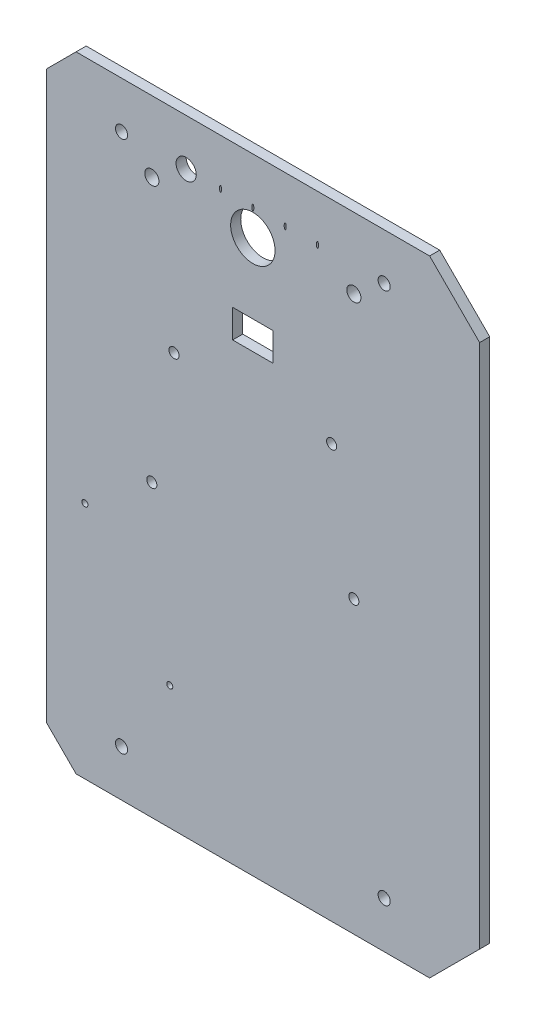
ISO-10303-21;
HEADER;
FILE_DESCRIPTION(('STEP AP214'),'2;1');
FILE_NAME('part.step','',(''),(''),'','','');
FILE_SCHEMA(('AUTOMOTIVE_DESIGN { 1 0 10303 214 1 1 1 1 }'));
ENDSEC;
DATA;
#1=APPLICATION_CONTEXT('core data for automotive mechanical design processes');
#2=APPLICATION_PROTOCOL_DEFINITION('international standard','automotive_design',2000,#1);
#3=PRODUCT_CONTEXT('',#1,'mechanical');
#4=PRODUCT('Part','Part','',(#3));
#5=PRODUCT_RELATED_PRODUCT_CATEGORY('part','',(#4));
#6=PRODUCT_DEFINITION_FORMATION('','',#4);
#7=PRODUCT_DEFINITION_CONTEXT('part definition',#1,'design');
#8=PRODUCT_DEFINITION('design','',#6,#7);
#9=PRODUCT_DEFINITION_SHAPE('','',#8);
#10=(LENGTH_UNIT() NAMED_UNIT(*) SI_UNIT(.MILLI.,.METRE.));
#11=(NAMED_UNIT(*) PLANE_ANGLE_UNIT() SI_UNIT($,.RADIAN.));
#12=(NAMED_UNIT(*) SI_UNIT($,.STERADIAN.) SOLID_ANGLE_UNIT());
#13=UNCERTAINTY_MEASURE_WITH_UNIT(LENGTH_MEASURE(1.E-05),#10,'distance_accuracy_value','');
#14=(GEOMETRIC_REPRESENTATION_CONTEXT(3) GLOBAL_UNCERTAINTY_ASSIGNED_CONTEXT((#13)) GLOBAL_UNIT_ASSIGNED_CONTEXT((#10,
#11,#12)) REPRESENTATION_CONTEXT('',''));
#15=CARTESIAN_POINT('',(0.,0.,0.));
#16=DIRECTION('',(0.,0.,1.));
#17=DIRECTION('',(1.,0.,0.));
#18=AXIS2_PLACEMENT_3D('',#15,#16,#17);
#19=CARTESIAN_POINT('',(24.7487373415291,24.7487373415292,5.));
#20=DIRECTION('',(-0.707106781186548,0.707106781186547,0.));
#21=DIRECTION('',(-0.707106781186547,-0.707106781186548,0.));
#22=AXIS2_PLACEMENT_3D('',#19,#20,#21);
#23=PLANE('',#22);
#24=DIRECTION('',(0.707106781186547,0.707106781186548,0.));
#25=VECTOR('',#24,1.);
#26=CARTESIAN_POINT('',(24.7487373415291,24.7487373415292,0.));
#27=LINE('',#26,#25);
#28=CARTESIAN_POINT('',(0.,0.,0.));
#29=VERTEX_POINT('',#28);
#30=CARTESIAN_POINT('',(24.7487373415291,24.7487373415292,0.));
#31=VERTEX_POINT('',#30);
#32=EDGE_CURVE('E149',#29,#31,#27,.T.);
#33=ORIENTED_EDGE('',*,*,#32,.T.);
#34=DIRECTION('',(0.,0.,-1.));
#35=VECTOR('',#34,1.);
#36=CARTESIAN_POINT('',(24.7487373415291,24.7487373415292,5.));
#37=LINE('',#36,#35);
#38=CARTESIAN_POINT('',(24.7487373415291,24.7487373415292,5.));
#39=VERTEX_POINT('',#38);
#40=EDGE_CURVE('E179',#39,#31,#37,.T.);
#41=ORIENTED_EDGE('',*,*,#40,.F.);
#42=DIRECTION('',(0.707106781186547,0.707106781186548,0.));
#43=VECTOR('',#42,1.);
#44=CARTESIAN_POINT('',(24.7487373415291,24.7487373415292,5.));
#45=LINE('',#44,#43);
#46=CARTESIAN_POINT('',(0.,0.,5.));
#47=VERTEX_POINT('',#46);
#48=EDGE_CURVE('E166',#47,#39,#45,.T.);
#49=ORIENTED_EDGE('',*,*,#48,.F.);
#50=DIRECTION('',(0.,0.,-1.));
#51=VECTOR('',#50,1.);
#52=CARTESIAN_POINT('',(0.,0.,5.));
#53=LINE('',#52,#51);
#54=EDGE_CURVE('E143',#47,#29,#53,.T.);
#55=ORIENTED_EDGE('',*,*,#54,.T.);
#56=EDGE_LOOP('',(#33,#41,#49,#55));
#57=FACE_BOUND('',#56,.T.);
#58=ADVANCED_FACE('F33',(#57),#23,.F.);
#59=CARTESIAN_POINT('',(24.7487373415292,284.748737341529,5.));
#60=DIRECTION('',(-1.,0.,0.));
#61=DIRECTION('',(0.,-1.,0.));
#62=AXIS2_PLACEMENT_3D('',#59,#60,#61);
#63=PLANE('',#62);
#64=DIRECTION('',(0.,1.,0.));
#65=VECTOR('',#64,1.);
#66=CARTESIAN_POINT('',(24.7487373415292,284.748737341529,0.));
#67=LINE('',#66,#65);
#68=CARTESIAN_POINT('',(24.7487373415292,284.748737341529,0.));
#69=VERTEX_POINT('',#68);
#70=EDGE_CURVE('E152',#31,#69,#67,.T.);
#71=ORIENTED_EDGE('',*,*,#70,.T.);
#72=DIRECTION('',(0.,0.,-1.));
#73=VECTOR('',#72,1.);
#74=CARTESIAN_POINT('',(24.7487373415292,284.748737341529,5.));
#75=LINE('',#74,#73);
#76=CARTESIAN_POINT('',(24.7487373415292,284.748737341529,5.));
#77=VERTEX_POINT('',#76);
#78=EDGE_CURVE('E176',#77,#69,#75,.T.);
#79=ORIENTED_EDGE('',*,*,#78,.F.);
#80=DIRECTION('',(0.,1.,0.));
#81=VECTOR('',#80,1.);
#82=CARTESIAN_POINT('',(24.7487373415292,284.748737341529,5.));
#83=LINE('',#82,#81);
#84=EDGE_CURVE('E410',#39,#77,#83,.T.);
#85=ORIENTED_EDGE('',*,*,#84,.F.);
#86=ORIENTED_EDGE('',*,*,#40,.T.);
#87=EDGE_LOOP('',(#71,#79,#85,#86));
#88=FACE_BOUND('',#87,.T.);
#89=ADVANCED_FACE('F291',(#88),#63,.F.);
#90=CARTESIAN_POINT('',(0.,309.497474683058,5.));
#91=DIRECTION('',(-0.707106781186547,-0.707106781186548,0.));
#92=DIRECTION('',(0.707106781186548,-0.707106781186547,0.));
#93=AXIS2_PLACEMENT_3D('',#90,#91,#92);
#94=PLANE('',#93);
#95=DIRECTION('',(-0.707106781186548,0.707106781186547,0.));
#96=VECTOR('',#95,1.);
#97=CARTESIAN_POINT('',(0.,309.497474683058,0.));
#98=LINE('',#97,#96);
#99=CARTESIAN_POINT('',(0.,309.497474683058,0.));
#100=VERTEX_POINT('',#99);
#101=EDGE_CURVE('E155',#69,#100,#98,.T.);
#102=ORIENTED_EDGE('',*,*,#101,.T.);
#103=DIRECTION('',(0.,0.,-1.));
#104=VECTOR('',#103,1.);
#105=CARTESIAN_POINT('',(0.,309.497474683058,5.));
#106=LINE('',#105,#104);
#107=CARTESIAN_POINT('',(0.,309.497474683058,5.));
#108=VERTEX_POINT('',#107);
#109=EDGE_CURVE('E173',#108,#100,#106,.T.);
#110=ORIENTED_EDGE('',*,*,#109,.F.);
#111=DIRECTION('',(-0.707106781186548,0.707106781186547,0.));
#112=VECTOR('',#111,1.);
#113=CARTESIAN_POINT('',(0.,309.497474683058,5.));
#114=LINE('',#113,#112);
#115=EDGE_CURVE('E306',#77,#108,#114,.T.);
#116=ORIENTED_EDGE('',*,*,#115,.F.);
#117=ORIENTED_EDGE('',*,*,#78,.T.);
#118=EDGE_LOOP('',(#102,#110,#116,#117));
#119=FACE_BOUND('',#118,.T.);
#120=ADVANCED_FACE('F288',(#119),#94,.F.);
#121=CARTESIAN_POINT('',(-175.,309.497474683058,5.));
#122=DIRECTION('',(0.,-1.,0.));
#123=DIRECTION('',(0.,0.,-1.));
#124=AXIS2_PLACEMENT_3D('',#121,#122,#123);
#125=PLANE('',#124);
#126=DIRECTION('',(-1.,0.,0.));
#127=VECTOR('',#126,1.);
#128=CARTESIAN_POINT('',(-175.,309.497474683058,0.));
#129=LINE('',#128,#127);
#130=CARTESIAN_POINT('',(-175.,309.497474683058,0.));
#131=VERTEX_POINT('',#130);
#132=EDGE_CURVE('E157',#100,#131,#129,.T.);
#133=ORIENTED_EDGE('',*,*,#132,.T.);
#134=DIRECTION('',(0.,0.,-1.));
#135=VECTOR('',#134,1.);
#136=CARTESIAN_POINT('',(-175.,309.497474683058,5.));
#137=LINE('',#136,#135);
#138=CARTESIAN_POINT('',(-175.,309.497474683058,5.));
#139=VERTEX_POINT('',#138);
#140=EDGE_CURVE('E170',#139,#131,#137,.T.);
#141=ORIENTED_EDGE('',*,*,#140,.F.);
#142=DIRECTION('',(-1.,0.,0.));
#143=VECTOR('',#142,1.);
#144=CARTESIAN_POINT('',(-175.,309.497474683058,5.));
#145=LINE('',#144,#143);
#146=EDGE_CURVE('E145',#108,#139,#145,.T.);
#147=ORIENTED_EDGE('',*,*,#146,.F.);
#148=ORIENTED_EDGE('',*,*,#109,.T.);
#149=EDGE_LOOP('',(#133,#141,#147,#148));
#150=FACE_BOUND('',#149,.T.);
#151=ADVANCED_FACE('F284',(#150),#125,.F.);
#152=CARTESIAN_POINT('',(-199.748737341529,284.748737341529,5.));
#153=DIRECTION('',(0.707106781186548,-0.707106781186548,0.));
#154=DIRECTION('',(0.707106781186548,0.707106781186548,0.));
#155=AXIS2_PLACEMENT_3D('',#152,#153,#154);
#156=PLANE('',#155);
#157=DIRECTION('',(-0.707106781186547,-0.707106781186547,0.));
#158=VECTOR('',#157,1.);
#159=CARTESIAN_POINT('',(-199.748737341529,284.748737341529,0.));
#160=LINE('',#159,#158);
#161=CARTESIAN_POINT('',(-189.748737341529,294.748737341529,0.));
#162=VERTEX_POINT('',#161);
#163=EDGE_CURVE('E159',#131,#162,#160,.T.);
#164=ORIENTED_EDGE('',*,*,#163,.T.);
#165=DIRECTION('',(0.,0.,1.));
#166=VECTOR('',#165,1.);
#167=CARTESIAN_POINT('',(-189.748737341529,294.748737341529,5.));
#168=LINE('',#167,#166);
#169=CARTESIAN_POINT('',(-189.748737341529,294.748737341529,5.));
#170=VERTEX_POINT('',#169);
#171=EDGE_CURVE('E46',#162,#170,#168,.T.);
#172=ORIENTED_EDGE('',*,*,#171,.T.);
#173=DIRECTION('',(-0.707106781186547,-0.707106781186547,0.));
#174=VECTOR('',#173,1.);
#175=CARTESIAN_POINT('',(-199.748737341529,284.748737341529,5.));
#176=LINE('',#175,#174);
#177=EDGE_CURVE('E134',#139,#170,#176,.T.);
#178=ORIENTED_EDGE('',*,*,#177,.F.);
#179=ORIENTED_EDGE('',*,*,#140,.T.);
#180=EDGE_LOOP('',(#164,#172,#178,#179));
#181=FACE_BOUND('',#180,.T.);
#182=ADVANCED_FACE('F281',(#181),#156,.F.);
#183=CARTESIAN_POINT('',(-175.,0.,5.));
#184=DIRECTION('',(0.707106781186547,0.707106781186548,0.));
#185=DIRECTION('',(-0.707106781186548,0.707106781186547,0.));
#186=AXIS2_PLACEMENT_3D('',#183,#184,#185);
#187=PLANE('',#186);
#188=DIRECTION('',(0.707106781186548,-0.707106781186547,0.));
#189=VECTOR('',#188,1.);
#190=CARTESIAN_POINT('',(-175.,0.,5.));
#191=LINE('',#190,#189);
#192=CARTESIAN_POINT('',(-189.748737341529,14.7487373415291,5.));
#193=VERTEX_POINT('',#192);
#194=CARTESIAN_POINT('',(-175.,0.,5.));
#195=VERTEX_POINT('',#194);
#196=EDGE_CURVE('E131',#193,#195,#191,.T.);
#197=ORIENTED_EDGE('',*,*,#196,.F.);
#198=DIRECTION('',(0.,0.,-1.));
#199=VECTOR('',#198,1.);
#200=CARTESIAN_POINT('',(-189.748737341529,14.7487373415291,5.));
#201=LINE('',#200,#199);
#202=CARTESIAN_POINT('',(-189.748737341529,14.7487373415291,0.));
#203=VERTEX_POINT('',#202);
#204=EDGE_CURVE('E119',#193,#203,#201,.T.);
#205=ORIENTED_EDGE('',*,*,#204,.T.);
#206=DIRECTION('',(0.707106781186548,-0.707106781186547,0.));
#207=VECTOR('',#206,1.);
#208=CARTESIAN_POINT('',(-175.,0.,0.));
#209=LINE('',#208,#207);
#210=CARTESIAN_POINT('',(-175.,0.,0.));
#211=VERTEX_POINT('',#210);
#212=EDGE_CURVE('E162',#203,#211,#209,.T.);
#213=ORIENTED_EDGE('',*,*,#212,.T.);
#214=DIRECTION('',(0.,0.,-1.));
#215=VECTOR('',#214,1.);
#216=CARTESIAN_POINT('',(-175.,0.,5.));
#217=LINE('',#216,#215);
#218=EDGE_CURVE('E139',#195,#211,#217,.T.);
#219=ORIENTED_EDGE('',*,*,#218,.F.);
#220=EDGE_LOOP('',(#197,#205,#213,#219));
#221=FACE_BOUND('',#220,.T.);
#222=ADVANCED_FACE('F137',(#221),#187,.F.);
#223=CARTESIAN_POINT('',(0.,0.,5.));
#224=DIRECTION('',(0.,1.,0.));
#225=DIRECTION('',(0.,0.,1.));
#226=AXIS2_PLACEMENT_3D('',#223,#224,#225);
#227=PLANE('',#226);
#228=DIRECTION('',(1.,0.,0.));
#229=VECTOR('',#228,1.);
#230=CARTESIAN_POINT('',(0.,0.,0.));
#231=LINE('',#230,#229);
#232=EDGE_CURVE('E164',#211,#29,#231,.T.);
#233=ORIENTED_EDGE('',*,*,#232,.T.);
#234=ORIENTED_EDGE('',*,*,#54,.F.);
#235=DIRECTION('',(1.,0.,0.));
#236=VECTOR('',#235,1.);
#237=CARTESIAN_POINT('',(0.,0.,5.));
#238=LINE('',#237,#236);
#239=EDGE_CURVE('E141',#195,#47,#238,.T.);
#240=ORIENTED_EDGE('',*,*,#239,.F.);
#241=ORIENTED_EDGE('',*,*,#218,.T.);
#242=EDGE_LOOP('',(#233,#234,#240,#241));
#243=FACE_BOUND('',#242,.T.);
#244=ADVANCED_FACE('F271',(#243),#227,.F.);
#245=CARTESIAN_POINT('',(0.,0.,5.));
#246=DIRECTION('',(0.,0.,-1.));
#247=DIRECTION('',(-1.,0.,0.));
#248=AXIS2_PLACEMENT_3D('',#245,#246,#247);
#249=PLANE('',#248);
#250=CARTESIAN_POINT('',(-128.614939474584,61.1523718393633,5.));
#251=DIRECTION('',(0.,0.,1.));
#252=DIRECTION('',(1.,0.,0.));
#253=AXIS2_PLACEMENT_3D('',#250,#251,#252);
#254=CIRCLE('',#253,1.49999999999997);
#255=CARTESIAN_POINT('',(-127.114939474584,61.1523718393633,5.));
#256=VERTEX_POINT('',#255);
#257=EDGE_CURVE('E508',#256,#256,#254,.T.);
#258=ORIENTED_EDGE('',*,*,#257,.F.);
#259=EDGE_LOOP('',(#258));
#260=FACE_BOUND('',#259,.T.);
#261=CARTESIAN_POINT('',(-170.614939474584,118.152371839363,5.));
#262=DIRECTION('',(0.,0.,1.));
#263=DIRECTION('',(1.,0.,0.));
#264=AXIS2_PLACEMENT_3D('',#261,#262,#263);
#265=CIRCLE('',#264,1.5);
#266=CARTESIAN_POINT('',(-169.114939474584,118.152371839363,5.));
#267=VERTEX_POINT('',#266);
#268=EDGE_CURVE('E135',#267,#267,#265,.T.);
#269=ORIENTED_EDGE('',*,*,#268,.F.);
#270=EDGE_LOOP('',(#269));
#271=FACE_BOUND('',#270,.T.);
#272=CARTESIAN_POINT('',(-137.5,143.748737341529,5.));
#273=DIRECTION('',(0.,0.,1.));
#274=DIRECTION('',(1.,0.,0.));
#275=AXIS2_PLACEMENT_3D('',#272,#273,#274);
#276=CIRCLE('',#275,2.5);
#277=CARTESIAN_POINT('',(-135.,143.748737341529,5.));
#278=VERTEX_POINT('',#277);
#279=EDGE_CURVE('E321',#278,#278,#276,.T.);
#280=ORIENTED_EDGE('',*,*,#279,.F.);
#281=EDGE_LOOP('',(#280));
#282=FACE_BOUND('',#281,.T.);
#283=CARTESIAN_POINT('',(-22.5012626584709,286.497474683058,5.));
#284=DIRECTION('',(0.,0.,1.));
#285=DIRECTION('',(1.,0.,0.));
#286=AXIS2_PLACEMENT_3D('',#283,#284,#285);
#287=CIRCLE('',#286,3.00000000000001);
#288=CARTESIAN_POINT('',(-19.5012626584709,286.497474683058,5.));
#289=VERTEX_POINT('',#288);
#290=EDGE_CURVE('E324',#289,#289,#287,.T.);
#291=ORIENTED_EDGE('',*,*,#290,.F.);
#292=EDGE_LOOP('',(#291));
#293=FACE_BOUND('',#292,.T.);
#294=CARTESIAN_POINT('',(-22.5012626584708,23.,5.));
#295=DIRECTION('',(0.,0.,1.));
#296=DIRECTION('',(-1.,0.,0.));
#297=AXIS2_PLACEMENT_3D('',#294,#295,#296);
#298=CIRCLE('',#297,2.99999999999999);
#299=CARTESIAN_POINT('',(-25.5012626584708,23.,5.));
#300=VERTEX_POINT('',#299);
#301=EDGE_CURVE('E327',#300,#300,#298,.T.);
#302=ORIENTED_EDGE('',*,*,#301,.F.);
#303=EDGE_LOOP('',(#302));
#304=FACE_BOUND('',#303,.T.);
#305=CARTESIAN_POINT('',(-152.498737341529,286.497474683058,5.));
#306=DIRECTION('',(0.,0.,1.));
#307=DIRECTION('',(-1.,0.,0.));
#308=AXIS2_PLACEMENT_3D('',#305,#306,#307);
#309=CIRCLE('',#308,2.99999999999999);
#310=CARTESIAN_POINT('',(-155.498737341529,286.497474683058,5.));
#311=VERTEX_POINT('',#310);
#312=EDGE_CURVE('E330',#311,#311,#309,.T.);
#313=ORIENTED_EDGE('',*,*,#312,.F.);
#314=EDGE_LOOP('',(#313));
#315=FACE_BOUND('',#314,.T.);
#316=CARTESIAN_POINT('',(-48.5,204.748737341529,5.));
#317=DIRECTION('',(0.,0.,1.));
#318=DIRECTION('',(-1.,0.,0.));
#319=AXIS2_PLACEMENT_3D('',#316,#317,#318);
#320=CIRCLE('',#319,2.5);
#321=CARTESIAN_POINT('',(-51.,204.748737341529,5.));
#322=VERTEX_POINT('',#321);
#323=EDGE_CURVE('E312',#322,#322,#320,.T.);
#324=ORIENTED_EDGE('',*,*,#323,.F.);
#325=EDGE_LOOP('',(#324));
#326=FACE_BOUND('',#325,.T.);
#327=CARTESIAN_POINT('',(-37.5,143.748737341529,5.));
#328=DIRECTION('',(0.,0.,1.));
#329=DIRECTION('',(-1.,0.,0.));
#330=AXIS2_PLACEMENT_3D('',#327,#328,#329);
#331=CIRCLE('',#330,2.5);
#332=CARTESIAN_POINT('',(-40.,143.748737341529,5.));
#333=VERTEX_POINT('',#332);
#334=EDGE_CURVE('E315',#333,#333,#331,.T.);
#335=ORIENTED_EDGE('',*,*,#334,.F.);
#336=EDGE_LOOP('',(#335));
#337=FACE_BOUND('',#336,.T.);
#338=CARTESIAN_POINT('',(-126.5,204.748737341529,5.));
#339=DIRECTION('',(0.,0.,1.));
#340=DIRECTION('',(1.,0.,0.));
#341=AXIS2_PLACEMENT_3D('',#338,#339,#340);
#342=CIRCLE('',#341,2.5);
#343=CARTESIAN_POINT('',(-124.,204.748737341529,5.));
#344=VERTEX_POINT('',#343);
#345=EDGE_CURVE('E318',#344,#344,#342,.T.);
#346=ORIENTED_EDGE('',*,*,#345,.F.);
#347=EDGE_LOOP('',(#346));
#348=FACE_BOUND('',#347,.T.);
#349=CARTESIAN_POINT('',(-152.498737341529,23.,5.));
#350=DIRECTION('',(0.,0.,1.));
#351=DIRECTION('',(1.,0.,0.));
#352=AXIS2_PLACEMENT_3D('',#349,#350,#351);
#353=CIRCLE('',#352,2.99999999999999);
#354=CARTESIAN_POINT('',(-149.498737341529,23.,5.));
#355=VERTEX_POINT('',#354);
#356=EDGE_CURVE('E219',#355,#355,#353,.T.);
#357=ORIENTED_EDGE('',*,*,#356,.F.);
#358=EDGE_LOOP('',(#357));
#359=FACE_BOUND('',#358,.T.);
#360=CARTESIAN_POINT('',(-55.5,286.497474683058,5.));
#361=DIRECTION('',(0.,0.,1.));
#362=DIRECTION('',(0.,-1.,0.));
#363=AXIS2_PLACEMENT_3D('',#360,#361,#362);
#364=ELLIPSE('',#363,1.5,0.5);
#365=CARTESIAN_POINT('',(-55.5,284.997474683058,5.));
#366=VERTEX_POINT('',#365);
#367=EDGE_CURVE('E238',#366,#366,#364,.T.);
#368=ORIENTED_EDGE('',*,*,#367,.F.);
#369=EDGE_LOOP('',(#368));
#370=FACE_BOUND('',#369,.T.);
#371=CARTESIAN_POINT('',(-71.5,286.497474683058,5.));
#372=DIRECTION('',(0.,0.,1.));
#373=DIRECTION('',(0.,-1.,0.));
#374=AXIS2_PLACEMENT_3D('',#371,#372,#373);
#375=ELLIPSE('',#374,1.5,0.5);
#376=CARTESIAN_POINT('',(-71.5,284.997474683058,5.));
#377=VERTEX_POINT('',#376);
#378=EDGE_CURVE('E242',#377,#377,#375,.T.);
#379=ORIENTED_EDGE('',*,*,#378,.F.);
#380=EDGE_LOOP('',(#379));
#381=FACE_BOUND('',#380,.T.);
#382=CARTESIAN_POINT('',(-87.5,286.497474683058,5.));
#383=DIRECTION('',(0.,0.,1.));
#384=DIRECTION('',(0.,-1.,0.));
#385=AXIS2_PLACEMENT_3D('',#382,#383,#384);
#386=ELLIPSE('',#385,1.5,0.5);
#387=CARTESIAN_POINT('',(-87.5,284.997474683058,5.));
#388=VERTEX_POINT('',#387);
#389=EDGE_CURVE('E247',#388,#388,#386,.T.);
#390=ORIENTED_EDGE('',*,*,#389,.F.);
#391=EDGE_LOOP('',(#390));
#392=FACE_BOUND('',#391,.T.);
#393=CARTESIAN_POINT('',(-87.5,273.497474683058,5.));
#394=DIRECTION('',(0.,0.,1.));
#395=DIRECTION('',(1.,0.,0.));
#396=AXIS2_PLACEMENT_3D('',#393,#394,#395);
#397=CIRCLE('',#396,11.);
#398=CARTESIAN_POINT('',(-76.5,273.497474683058,5.));
#399=VERTEX_POINT('',#398);
#400=EDGE_CURVE('E359',#399,#399,#397,.T.);
#401=ORIENTED_EDGE('',*,*,#400,.F.);
#402=EDGE_LOOP('',(#401));
#403=FACE_BOUND('',#402,.T.);
#404=CARTESIAN_POINT('',(-37.5,274.497474683058,5.));
#405=DIRECTION('',(0.,0.,1.));
#406=DIRECTION('',(1.,0.,0.));
#407=AXIS2_PLACEMENT_3D('',#404,#405,#406);
#408=CIRCLE('',#407,3.50000000000001);
#409=CARTESIAN_POINT('',(-34.,274.497474683058,5.));
#410=VERTEX_POINT('',#409);
#411=EDGE_CURVE('E340',#410,#410,#408,.T.);
#412=ORIENTED_EDGE('',*,*,#411,.F.);
#413=EDGE_LOOP('',(#412));
#414=FACE_BOUND('',#413,.T.);
#415=CARTESIAN_POINT('',(-137.5,274.497474683058,5.));
#416=DIRECTION('',(0.,0.,1.));
#417=DIRECTION('',(1.,0.,0.));
#418=AXIS2_PLACEMENT_3D('',#415,#416,#417);
#419=CIRCLE('',#418,3.50000000000002);
#420=CARTESIAN_POINT('',(-134.,274.497474683058,5.));
#421=VERTEX_POINT('',#420);
#422=EDGE_CURVE('E337',#421,#421,#419,.T.);
#423=ORIENTED_EDGE('',*,*,#422,.F.);
#424=EDGE_LOOP('',(#423));
#425=FACE_BOUND('',#424,.T.);
#426=DIRECTION('',(1.,0.,0.));
#427=VECTOR('',#426,1.);
#428=CARTESIAN_POINT('',(-97.5,224.748737341529,5.));
#429=LINE('',#428,#427);
#430=CARTESIAN_POINT('',(-97.5,224.748737341529,5.));
#431=VERTEX_POINT('',#430);
#432=CARTESIAN_POINT('',(-77.5,224.748737341529,5.));
#433=VERTEX_POINT('',#432);
#434=EDGE_CURVE('E343',#431,#433,#429,.T.);
#435=ORIENTED_EDGE('',*,*,#434,.F.);
#436=DIRECTION('',(0.,-1.,0.));
#437=VECTOR('',#436,1.);
#438=CARTESIAN_POINT('',(-97.5,238.748737341529,5.));
#439=LINE('',#438,#437);
#440=CARTESIAN_POINT('',(-97.5,238.748737341529,5.));
#441=VERTEX_POINT('',#440);
#442=EDGE_CURVE('E54',#441,#431,#439,.T.);
#443=ORIENTED_EDGE('',*,*,#442,.F.);
#444=DIRECTION('',(-1.,0.,0.));
#445=VECTOR('',#444,1.);
#446=CARTESIAN_POINT('',(-97.5,238.748737341529,5.));
#447=LINE('',#446,#445);
#448=CARTESIAN_POINT('',(-77.5,238.748737341529,5.));
#449=VERTEX_POINT('',#448);
#450=EDGE_CURVE('E349',#449,#441,#447,.T.);
#451=ORIENTED_EDGE('',*,*,#450,.F.);
#452=DIRECTION('',(0.,1.,0.));
#453=VECTOR('',#452,1.);
#454=CARTESIAN_POINT('',(-77.5,238.748737341529,5.));
#455=LINE('',#454,#453);
#456=EDGE_CURVE('E346',#433,#449,#455,.T.);
#457=ORIENTED_EDGE('',*,*,#456,.F.);
#458=EDGE_LOOP('',(#435,#443,#451,#457));
#459=FACE_BOUND('',#458,.T.);
#460=CARTESIAN_POINT('',(-103.5,286.497474683058,5.));
#461=DIRECTION('',(0.,0.,1.));
#462=DIRECTION('',(0.,-1.,0.));
#463=AXIS2_PLACEMENT_3D('',#460,#461,#462);
#464=ELLIPSE('',#463,1.5,0.5);
#465=CARTESIAN_POINT('',(-103.5,284.997474683058,5.));
#466=VERTEX_POINT('',#465);
#467=EDGE_CURVE('E190',#466,#466,#464,.T.);
#468=ORIENTED_EDGE('',*,*,#467,.F.);
#469=EDGE_LOOP('',(#468));
#470=FACE_BOUND('',#469,.T.);
#471=CARTESIAN_POINT('',(-120.5,286.497474683058,5.));
#472=DIRECTION('',(0.,0.,1.));
#473=DIRECTION('',(1.,0.,0.));
#474=AXIS2_PLACEMENT_3D('',#471,#472,#473);
#475=CIRCLE('',#474,5.00000000000001);
#476=CARTESIAN_POINT('',(-115.5,286.497474683058,5.));
#477=VERTEX_POINT('',#476);
#478=EDGE_CURVE('E185',#477,#477,#475,.T.);
#479=ORIENTED_EDGE('',*,*,#478,.F.);
#480=EDGE_LOOP('',(#479));
#481=FACE_BOUND('',#480,.T.);
#482=ORIENTED_EDGE('',*,*,#177,.T.);
#483=DIRECTION('',(0.,1.,0.));
#484=VECTOR('',#483,1.);
#485=CARTESIAN_POINT('',(-189.748737341529,134.748737341529,5.));
#486=LINE('',#485,#484);
#487=EDGE_CURVE('E122',#193,#170,#486,.T.);
#488=ORIENTED_EDGE('',*,*,#487,.F.);
#489=ORIENTED_EDGE('',*,*,#196,.T.);
#490=ORIENTED_EDGE('',*,*,#239,.T.);
#491=ORIENTED_EDGE('',*,*,#48,.T.);
#492=ORIENTED_EDGE('',*,*,#84,.T.);
#493=ORIENTED_EDGE('',*,*,#115,.T.);
#494=ORIENTED_EDGE('',*,*,#146,.T.);
#495=EDGE_LOOP('',(#482,#488,#489,#490,#491,#492,#493,#494));
#496=FACE_BOUND('',#495,.T.);
#497=ADVANCED_FACE('F130',(#260,#271,#282,#293,#304,#315,#326,#337,#348,#359,#370,#381,#392,
#403,#414,#425,#459,#470,#481,#496),#249,.F.);
#498=CARTESIAN_POINT('',(0.,0.,0.));
#499=DIRECTION('',(0.,0.,-1.));
#500=DIRECTION('',(-1.,0.,0.));
#501=AXIS2_PLACEMENT_3D('',#498,#499,#500);
#502=PLANE('',#501);
#503=CARTESIAN_POINT('',(-128.614939474584,61.1523718393633,0.));
#504=DIRECTION('',(0.,0.,1.));
#505=DIRECTION('',(1.,0.,0.));
#506=AXIS2_PLACEMENT_3D('',#503,#504,#505);
#507=CIRCLE('',#506,1.49999999999997);
#508=CARTESIAN_POINT('',(-127.114939474584,61.1523718393633,0.));
#509=VERTEX_POINT('',#508);
#510=EDGE_CURVE('E126',#509,#509,#507,.T.);
#511=ORIENTED_EDGE('',*,*,#510,.T.);
#512=EDGE_LOOP('',(#511));
#513=FACE_BOUND('',#512,.T.);
#514=CARTESIAN_POINT('',(-170.614939474584,118.152371839363,0.));
#515=DIRECTION('',(0.,0.,1.));
#516=DIRECTION('',(1.,0.,0.));
#517=AXIS2_PLACEMENT_3D('',#514,#515,#516);
#518=CIRCLE('',#517,1.5);
#519=CARTESIAN_POINT('',(-169.114939474584,118.152371839363,0.));
#520=VERTEX_POINT('',#519);
#521=EDGE_CURVE('E509',#520,#520,#518,.T.);
#522=ORIENTED_EDGE('',*,*,#521,.T.);
#523=EDGE_LOOP('',(#522));
#524=FACE_BOUND('',#523,.T.);
#525=DIRECTION('',(0.,-1.,0.));
#526=VECTOR('',#525,1.);
#527=CARTESIAN_POINT('',(-189.748737341529,0.,0.));
#528=LINE('',#527,#526);
#529=EDGE_CURVE('E11',#162,#203,#528,.T.);
#530=ORIENTED_EDGE('',*,*,#529,.F.);
#531=ORIENTED_EDGE('',*,*,#163,.F.);
#532=ORIENTED_EDGE('',*,*,#132,.F.);
#533=ORIENTED_EDGE('',*,*,#101,.F.);
#534=ORIENTED_EDGE('',*,*,#70,.F.);
#535=ORIENTED_EDGE('',*,*,#32,.F.);
#536=ORIENTED_EDGE('',*,*,#232,.F.);
#537=ORIENTED_EDGE('',*,*,#212,.F.);
#538=EDGE_LOOP('',(#530,#531,#532,#533,#534,#535,#536,#537));
#539=FACE_BOUND('',#538,.T.);
#540=CARTESIAN_POINT('',(-137.5,143.748737341529,0.));
#541=DIRECTION('',(0.,0.,-1.));
#542=DIRECTION('',(-1.,0.,0.));
#543=AXIS2_PLACEMENT_3D('',#540,#541,#542);
#544=CIRCLE('',#543,2.5);
#545=CARTESIAN_POINT('',(-140.,143.748737341529,0.));
#546=VERTEX_POINT('',#545);
#547=EDGE_CURVE('E236',#546,#546,#544,.T.);
#548=ORIENTED_EDGE('',*,*,#547,.F.);
#549=EDGE_LOOP('',(#548));
#550=FACE_BOUND('',#549,.T.);
#551=CARTESIAN_POINT('',(-22.5012626584709,286.497474683058,0.));
#552=DIRECTION('',(0.,0.,-1.));
#553=DIRECTION('',(-1.,0.,0.));
#554=AXIS2_PLACEMENT_3D('',#551,#552,#553);
#555=CIRCLE('',#554,3.00000000000001);
#556=CARTESIAN_POINT('',(-25.5012626584709,286.497474683058,0.));
#557=VERTEX_POINT('',#556);
#558=EDGE_CURVE('E234',#557,#557,#555,.T.);
#559=ORIENTED_EDGE('',*,*,#558,.F.);
#560=EDGE_LOOP('',(#559));
#561=FACE_BOUND('',#560,.T.);
#562=CARTESIAN_POINT('',(-22.5012626584708,23.,0.));
#563=DIRECTION('',(0.,0.,-1.));
#564=DIRECTION('',(-1.,0.,0.));
#565=AXIS2_PLACEMENT_3D('',#562,#563,#564);
#566=CIRCLE('',#565,2.99999999999999);
#567=CARTESIAN_POINT('',(-25.5012626584708,23.,0.));
#568=VERTEX_POINT('',#567);
#569=EDGE_CURVE('E231',#568,#568,#566,.T.);
#570=ORIENTED_EDGE('',*,*,#569,.F.);
#571=EDGE_LOOP('',(#570));
#572=FACE_BOUND('',#571,.T.);
#573=CARTESIAN_POINT('',(-152.498737341529,286.497474683058,0.));
#574=DIRECTION('',(0.,0.,-1.));
#575=DIRECTION('',(-1.,0.,0.));
#576=AXIS2_PLACEMENT_3D('',#573,#574,#575);
#577=CIRCLE('',#576,2.99999999999999);
#578=CARTESIAN_POINT('',(-155.498737341529,286.497474683058,0.));
#579=VERTEX_POINT('',#578);
#580=EDGE_CURVE('E228',#579,#579,#577,.T.);
#581=ORIENTED_EDGE('',*,*,#580,.F.);
#582=EDGE_LOOP('',(#581));
#583=FACE_BOUND('',#582,.T.);
#584=CARTESIAN_POINT('',(-48.5,204.748737341529,0.));
#585=DIRECTION('',(0.,0.,-1.));
#586=DIRECTION('',(-1.,0.,0.));
#587=AXIS2_PLACEMENT_3D('',#584,#585,#586);
#588=CIRCLE('',#587,2.5);
#589=CARTESIAN_POINT('',(-51.,204.748737341529,0.));
#590=VERTEX_POINT('',#589);
#591=EDGE_CURVE('E225',#590,#590,#588,.T.);
#592=ORIENTED_EDGE('',*,*,#591,.F.);
#593=EDGE_LOOP('',(#592));
#594=FACE_BOUND('',#593,.T.);
#595=CARTESIAN_POINT('',(-37.5,143.748737341529,0.));
#596=DIRECTION('',(0.,0.,-1.));
#597=DIRECTION('',(-1.,0.,0.));
#598=AXIS2_PLACEMENT_3D('',#595,#596,#597);
#599=CIRCLE('',#598,2.5);
#600=CARTESIAN_POINT('',(-40.,143.748737341529,0.));
#601=VERTEX_POINT('',#600);
#602=EDGE_CURVE('E222',#601,#601,#599,.T.);
#603=ORIENTED_EDGE('',*,*,#602,.F.);
#604=EDGE_LOOP('',(#603));
#605=FACE_BOUND('',#604,.T.);
#606=CARTESIAN_POINT('',(-126.5,204.748737341529,0.));
#607=DIRECTION('',(0.,0.,-1.));
#608=DIRECTION('',(-1.,0.,0.));
#609=AXIS2_PLACEMENT_3D('',#606,#607,#608);
#610=CIRCLE('',#609,2.5);
#611=CARTESIAN_POINT('',(-129.,204.748737341529,0.));
#612=VERTEX_POINT('',#611);
#613=EDGE_CURVE('E218',#612,#612,#610,.T.);
#614=ORIENTED_EDGE('',*,*,#613,.F.);
#615=EDGE_LOOP('',(#614));
#616=FACE_BOUND('',#615,.T.);
#617=CARTESIAN_POINT('',(-152.498737341529,23.,0.));
#618=DIRECTION('',(0.,0.,-1.));
#619=DIRECTION('',(-1.,0.,0.));
#620=AXIS2_PLACEMENT_3D('',#617,#618,#619);
#621=CIRCLE('',#620,2.99999999999999);
#622=CARTESIAN_POINT('',(-155.498737341529,23.,0.));
#623=VERTEX_POINT('',#622);
#624=EDGE_CURVE('E215',#623,#623,#621,.T.);
#625=ORIENTED_EDGE('',*,*,#624,.F.);
#626=EDGE_LOOP('',(#625));
#627=FACE_BOUND('',#626,.T.);
#628=CARTESIAN_POINT('',(-55.5,286.497474683058,0.));
#629=DIRECTION('',(0.,0.,1.));
#630=DIRECTION('',(0.,-1.,0.));
#631=AXIS2_PLACEMENT_3D('',#628,#629,#630);
#632=ELLIPSE('',#631,1.5,0.5);
#633=CARTESIAN_POINT('',(-55.5,284.997474683058,0.));
#634=VERTEX_POINT('',#633);
#635=EDGE_CURVE('E212',#634,#634,#632,.F.);
#636=ORIENTED_EDGE('',*,*,#635,.F.);
#637=EDGE_LOOP('',(#636));
#638=FACE_BOUND('',#637,.T.);
#639=CARTESIAN_POINT('',(-71.5,286.497474683058,0.));
#640=DIRECTION('',(0.,0.,1.));
#641=DIRECTION('',(0.,-1.,0.));
#642=AXIS2_PLACEMENT_3D('',#639,#640,#641);
#643=ELLIPSE('',#642,1.5,0.5);
#644=CARTESIAN_POINT('',(-71.5,284.997474683058,0.));
#645=VERTEX_POINT('',#644);
#646=EDGE_CURVE('E209',#645,#645,#643,.F.);
#647=ORIENTED_EDGE('',*,*,#646,.F.);
#648=EDGE_LOOP('',(#647));
#649=FACE_BOUND('',#648,.T.);
#650=CARTESIAN_POINT('',(-87.5,286.497474683058,0.));
#651=DIRECTION('',(0.,0.,1.));
#652=DIRECTION('',(0.,-1.,0.));
#653=AXIS2_PLACEMENT_3D('',#650,#651,#652);
#654=ELLIPSE('',#653,1.5,0.5);
#655=CARTESIAN_POINT('',(-87.5,284.997474683058,0.));
#656=VERTEX_POINT('',#655);
#657=EDGE_CURVE('E206',#656,#656,#654,.F.);
#658=ORIENTED_EDGE('',*,*,#657,.F.);
#659=EDGE_LOOP('',(#658));
#660=FACE_BOUND('',#659,.T.);
#661=CARTESIAN_POINT('',(-87.5,273.497474683058,0.));
#662=DIRECTION('',(0.,0.,-1.));
#663=DIRECTION('',(-1.,0.,0.));
#664=AXIS2_PLACEMENT_3D('',#661,#662,#663);
#665=CIRCLE('',#664,11.);
#666=CARTESIAN_POINT('',(-98.5,273.497474683058,0.));
#667=VERTEX_POINT('',#666);
#668=EDGE_CURVE('E203',#667,#667,#665,.T.);
#669=ORIENTED_EDGE('',*,*,#668,.F.);
#670=EDGE_LOOP('',(#669));
#671=FACE_BOUND('',#670,.T.);
#672=CARTESIAN_POINT('',(-37.5,274.497474683058,0.));
#673=DIRECTION('',(0.,0.,-1.));
#674=DIRECTION('',(-1.,0.,0.));
#675=AXIS2_PLACEMENT_3D('',#672,#673,#674);
#676=CIRCLE('',#675,3.50000000000001);
#677=CARTESIAN_POINT('',(-41.,274.497474683058,0.));
#678=VERTEX_POINT('',#677);
#679=EDGE_CURVE('E200',#678,#678,#676,.T.);
#680=ORIENTED_EDGE('',*,*,#679,.F.);
#681=EDGE_LOOP('',(#680));
#682=FACE_BOUND('',#681,.T.);
#683=CARTESIAN_POINT('',(-137.5,274.497474683058,0.));
#684=DIRECTION('',(0.,0.,-1.));
#685=DIRECTION('',(-1.,0.,0.));
#686=AXIS2_PLACEMENT_3D('',#683,#684,#685);
#687=CIRCLE('',#686,3.50000000000002);
#688=CARTESIAN_POINT('',(-141.,274.497474683058,0.));
#689=VERTEX_POINT('',#688);
#690=EDGE_CURVE('E189',#689,#689,#687,.T.);
#691=ORIENTED_EDGE('',*,*,#690,.F.);
#692=EDGE_LOOP('',(#691));
#693=FACE_BOUND('',#692,.T.);
#694=DIRECTION('',(0.,1.,0.));
#695=VECTOR('',#694,1.);
#696=CARTESIAN_POINT('',(-97.5000000000003,0.,0.));
#697=LINE('',#696,#695);
#698=CARTESIAN_POINT('',(-97.5,224.748737341529,0.));
#699=VERTEX_POINT('',#698);
#700=CARTESIAN_POINT('',(-97.5,238.748737341529,0.));
#701=VERTEX_POINT('',#700);
#702=EDGE_CURVE('E40',#699,#701,#697,.T.);
#703=ORIENTED_EDGE('',*,*,#702,.F.);
#704=DIRECTION('',(-1.,0.,0.));
#705=VECTOR('',#704,1.);
#706=CARTESIAN_POINT('',(0.,224.748737341529,0.));
#707=LINE('',#706,#705);
#708=CARTESIAN_POINT('',(-77.5,224.748737341529,0.));
#709=VERTEX_POINT('',#708);
#710=EDGE_CURVE('E182',#709,#699,#707,.T.);
#711=ORIENTED_EDGE('',*,*,#710,.F.);
#712=DIRECTION('',(0.,-1.,0.));
#713=VECTOR('',#712,1.);
#714=CARTESIAN_POINT('',(-77.4999999999998,0.,0.));
#715=LINE('',#714,#713);
#716=CARTESIAN_POINT('',(-77.5,238.748737341529,0.));
#717=VERTEX_POINT('',#716);
#718=EDGE_CURVE('E192',#717,#709,#715,.T.);
#719=ORIENTED_EDGE('',*,*,#718,.F.);
#720=DIRECTION('',(1.,0.,0.));
#721=VECTOR('',#720,1.);
#722=CARTESIAN_POINT('',(0.,238.748737341529,0.));
#723=LINE('',#722,#721);
#724=EDGE_CURVE('E195',#701,#717,#723,.T.);
#725=ORIENTED_EDGE('',*,*,#724,.F.);
#726=EDGE_LOOP('',(#703,#711,#719,#725));
#727=FACE_BOUND('',#726,.T.);
#728=CARTESIAN_POINT('',(-103.5,286.497474683058,0.));
#729=DIRECTION('',(0.,0.,1.));
#730=DIRECTION('',(0.,-1.,0.));
#731=AXIS2_PLACEMENT_3D('',#728,#729,#730);
#732=ELLIPSE('',#731,1.5,0.5);
#733=CARTESIAN_POINT('',(-103.5,284.997474683058,0.));
#734=VERTEX_POINT('',#733);
#735=EDGE_CURVE('E186',#734,#734,#732,.F.);
#736=ORIENTED_EDGE('',*,*,#735,.F.);
#737=EDGE_LOOP('',(#736));
#738=FACE_BOUND('',#737,.T.);
#739=CARTESIAN_POINT('',(-120.5,286.497474683058,0.));
#740=DIRECTION('',(0.,0.,-1.));
#741=DIRECTION('',(-1.,0.,0.));
#742=AXIS2_PLACEMENT_3D('',#739,#740,#741);
#743=CIRCLE('',#742,5.00000000000001);
#744=CARTESIAN_POINT('',(-125.5,286.497474683058,0.));
#745=VERTEX_POINT('',#744);
#746=EDGE_CURVE('E153',#745,#745,#743,.T.);
#747=ORIENTED_EDGE('',*,*,#746,.F.);
#748=EDGE_LOOP('',(#747));
#749=FACE_BOUND('',#748,.T.);
#750=ADVANCED_FACE('F267',(#513,#524,#539,#550,#561,#572,#583,#594,#605,#616,#627,#638,#649,
#660,#671,#682,#693,#727,#738,#749),#502,.T.);
#751=CARTESIAN_POINT('',(-120.5,286.497474683058,-5.));
#752=DIRECTION('',(0.,0.,1.));
#753=DIRECTION('',(1.,0.,0.));
#754=AXIS2_PLACEMENT_3D('',#751,#752,#753);
#755=CYLINDRICAL_SURFACE('',#754,5.00000000000001);
#756=ORIENTED_EDGE('',*,*,#746,.T.);
#757=EDGE_LOOP('',(#756));
#758=FACE_BOUND('',#757,.T.);
#759=ORIENTED_EDGE('',*,*,#478,.T.);
#760=EDGE_LOOP('',(#759));
#761=FACE_BOUND('',#760,.T.);
#762=ADVANCED_FACE('F261',(#758,#761),#755,.F.);
#763=CARTESIAN_POINT('',(-103.5,286.497474683058,-5.));
#764=DIRECTION('',(0.,0.,1.));
#765=DIRECTION('',(0.,-1.,0.));
#766=AXIS2_PLACEMENT_3D('',#763,#764,#765);
#767=ELLIPSE('',#766,1.5,0.5);
#768=DIRECTION('',(0.,0.,1.));
#769=VECTOR('',#768,1.);
#770=SURFACE_OF_LINEAR_EXTRUSION('',#767,#769);
#771=ORIENTED_EDGE('',*,*,#735,.T.);
#772=EDGE_LOOP('',(#771));
#773=FACE_BOUND('',#772,.T.);
#774=ORIENTED_EDGE('',*,*,#467,.T.);
#775=EDGE_LOOP('',(#774));
#776=FACE_BOUND('',#775,.T.);
#777=ADVANCED_FACE('F256',(#773,#776),#770,.F.);
#778=CARTESIAN_POINT('',(-97.5,238.748737341529,-5.));
#779=DIRECTION('',(-1.,0.,0.));
#780=DIRECTION('',(0.,-1.,0.));
#781=AXIS2_PLACEMENT_3D('',#778,#779,#780);
#782=PLANE('',#781);
#783=ORIENTED_EDGE('',*,*,#702,.T.);
#784=DIRECTION('',(0.,0.,1.));
#785=VECTOR('',#784,1.);
#786=CARTESIAN_POINT('',(-97.5,238.748737341529,-5.));
#787=LINE('',#786,#785);
#788=EDGE_CURVE('E341',#701,#441,#787,.T.);
#789=ORIENTED_EDGE('',*,*,#788,.T.);
#790=ORIENTED_EDGE('',*,*,#442,.T.);
#791=DIRECTION('',(0.,0.,1.));
#792=VECTOR('',#791,1.);
#793=CARTESIAN_POINT('',(-97.5,224.748737341529,-5.));
#794=LINE('',#793,#792);
#795=EDGE_CURVE('E352',#699,#431,#794,.T.);
#796=ORIENTED_EDGE('',*,*,#795,.F.);
#797=EDGE_LOOP('',(#783,#789,#790,#796));
#798=FACE_BOUND('',#797,.T.);
#799=ADVANCED_FACE('F260',(#798),#782,.F.);
#800=CARTESIAN_POINT('',(-97.5,238.748737341529,-5.));
#801=DIRECTION('',(0.,1.,0.));
#802=DIRECTION('',(0.,0.,1.));
#803=AXIS2_PLACEMENT_3D('',#800,#801,#802);
#804=PLANE('',#803);
#805=ORIENTED_EDGE('',*,*,#724,.T.);
#806=DIRECTION('',(0.,0.,1.));
#807=VECTOR('',#806,1.);
#808=CARTESIAN_POINT('',(-77.5,238.748737341529,-5.));
#809=LINE('',#808,#807);
#810=EDGE_CURVE('E354',#717,#449,#809,.T.);
#811=ORIENTED_EDGE('',*,*,#810,.T.);
#812=ORIENTED_EDGE('',*,*,#450,.T.);
#813=ORIENTED_EDGE('',*,*,#788,.F.);
#814=EDGE_LOOP('',(#805,#811,#812,#813));
#815=FACE_BOUND('',#814,.T.);
#816=ADVANCED_FACE('F428',(#815),#804,.F.);
#817=CARTESIAN_POINT('',(-77.5,238.748737341529,-5.));
#818=DIRECTION('',(1.,0.,0.));
#819=DIRECTION('',(0.,1.,0.));
#820=AXIS2_PLACEMENT_3D('',#817,#818,#819);
#821=PLANE('',#820);
#822=ORIENTED_EDGE('',*,*,#718,.T.);
#823=DIRECTION('',(0.,0.,1.));
#824=VECTOR('',#823,1.);
#825=CARTESIAN_POINT('',(-77.5,224.748737341529,-5.));
#826=LINE('',#825,#824);
#827=EDGE_CURVE('E356',#709,#433,#826,.T.);
#828=ORIENTED_EDGE('',*,*,#827,.T.);
#829=ORIENTED_EDGE('',*,*,#456,.T.);
#830=ORIENTED_EDGE('',*,*,#810,.F.);
#831=EDGE_LOOP('',(#822,#828,#829,#830));
#832=FACE_BOUND('',#831,.T.);
#833=ADVANCED_FACE('F430',(#832),#821,.F.);
#834=CARTESIAN_POINT('',(-97.5,224.748737341529,-5.));
#835=DIRECTION('',(0.,-1.,0.));
#836=DIRECTION('',(0.,0.,-1.));
#837=AXIS2_PLACEMENT_3D('',#834,#835,#836);
#838=PLANE('',#837);
#839=ORIENTED_EDGE('',*,*,#710,.T.);
#840=ORIENTED_EDGE('',*,*,#795,.T.);
#841=ORIENTED_EDGE('',*,*,#434,.T.);
#842=ORIENTED_EDGE('',*,*,#827,.F.);
#843=EDGE_LOOP('',(#839,#840,#841,#842));
#844=FACE_BOUND('',#843,.T.);
#845=ADVANCED_FACE('F418',(#844),#838,.F.);
#846=CARTESIAN_POINT('',(-137.5,274.497474683058,-5.));
#847=DIRECTION('',(0.,0.,1.));
#848=DIRECTION('',(1.,0.,0.));
#849=AXIS2_PLACEMENT_3D('',#846,#847,#848);
#850=CYLINDRICAL_SURFACE('',#849,3.50000000000002);
#851=ORIENTED_EDGE('',*,*,#690,.T.);
#852=EDGE_LOOP('',(#851));
#853=FACE_BOUND('',#852,.T.);
#854=ORIENTED_EDGE('',*,*,#422,.T.);
#855=EDGE_LOOP('',(#854));
#856=FACE_BOUND('',#855,.T.);
#857=ADVANCED_FACE('F437',(#853,#856),#850,.F.);
#858=CARTESIAN_POINT('',(-37.5,274.497474683058,-5.));
#859=DIRECTION('',(0.,0.,1.));
#860=DIRECTION('',(1.,0.,0.));
#861=AXIS2_PLACEMENT_3D('',#858,#859,#860);
#862=CYLINDRICAL_SURFACE('',#861,3.50000000000001);
#863=ORIENTED_EDGE('',*,*,#679,.T.);
#864=EDGE_LOOP('',(#863));
#865=FACE_BOUND('',#864,.T.);
#866=ORIENTED_EDGE('',*,*,#411,.T.);
#867=EDGE_LOOP('',(#866));
#868=FACE_BOUND('',#867,.T.);
#869=ADVANCED_FACE('F374',(#865,#868),#862,.F.);
#870=CARTESIAN_POINT('',(-87.5,273.497474683058,-5.));
#871=DIRECTION('',(0.,0.,1.));
#872=DIRECTION('',(1.,0.,0.));
#873=AXIS2_PLACEMENT_3D('',#870,#871,#872);
#874=CYLINDRICAL_SURFACE('',#873,11.);
#875=ORIENTED_EDGE('',*,*,#668,.T.);
#876=EDGE_LOOP('',(#875));
#877=FACE_BOUND('',#876,.T.);
#878=ORIENTED_EDGE('',*,*,#400,.T.);
#879=EDGE_LOOP('',(#878));
#880=FACE_BOUND('',#879,.T.);
#881=ADVANCED_FACE('F372',(#877,#880),#874,.F.);
#882=CARTESIAN_POINT('',(-87.5,286.497474683058,-5.));
#883=DIRECTION('',(0.,0.,1.));
#884=DIRECTION('',(0.,-1.,0.));
#885=AXIS2_PLACEMENT_3D('',#882,#883,#884);
#886=ELLIPSE('',#885,1.5,0.5);
#887=DIRECTION('',(0.,0.,1.));
#888=VECTOR('',#887,1.);
#889=SURFACE_OF_LINEAR_EXTRUSION('',#886,#888);
#890=ORIENTED_EDGE('',*,*,#657,.T.);
#891=EDGE_LOOP('',(#890));
#892=FACE_BOUND('',#891,.T.);
#893=ORIENTED_EDGE('',*,*,#389,.T.);
#894=EDGE_LOOP('',(#893));
#895=FACE_BOUND('',#894,.T.);
#896=ADVANCED_FACE('F368',(#892,#895),#889,.F.);
#897=CARTESIAN_POINT('',(-71.5,286.497474683058,-5.));
#898=DIRECTION('',(0.,0.,1.));
#899=DIRECTION('',(0.,-1.,0.));
#900=AXIS2_PLACEMENT_3D('',#897,#898,#899);
#901=ELLIPSE('',#900,1.5,0.5);
#902=DIRECTION('',(0.,0.,1.));
#903=VECTOR('',#902,1.);
#904=SURFACE_OF_LINEAR_EXTRUSION('',#901,#903);
#905=ORIENTED_EDGE('',*,*,#646,.T.);
#906=EDGE_LOOP('',(#905));
#907=FACE_BOUND('',#906,.T.);
#908=ORIENTED_EDGE('',*,*,#378,.T.);
#909=EDGE_LOOP('',(#908));
#910=FACE_BOUND('',#909,.T.);
#911=ADVANCED_FACE('F371',(#907,#910),#904,.F.);
#912=CARTESIAN_POINT('',(-55.5,286.497474683058,-5.));
#913=DIRECTION('',(0.,0.,1.));
#914=DIRECTION('',(0.,-1.,0.));
#915=AXIS2_PLACEMENT_3D('',#912,#913,#914);
#916=ELLIPSE('',#915,1.5,0.5);
#917=DIRECTION('',(0.,0.,1.));
#918=VECTOR('',#917,1.);
#919=SURFACE_OF_LINEAR_EXTRUSION('',#916,#918);
#920=ORIENTED_EDGE('',*,*,#635,.T.);
#921=EDGE_LOOP('',(#920));
#922=FACE_BOUND('',#921,.T.);
#923=ORIENTED_EDGE('',*,*,#367,.T.);
#924=EDGE_LOOP('',(#923));
#925=FACE_BOUND('',#924,.T.);
#926=ADVANCED_FACE('F263',(#922,#925),#919,.F.);
#927=CARTESIAN_POINT('',(-152.498737341529,23.,-5.));
#928=DIRECTION('',(0.,0.,1.));
#929=DIRECTION('',(1.,0.,0.));
#930=AXIS2_PLACEMENT_3D('',#927,#928,#929);
#931=CYLINDRICAL_SURFACE('',#930,2.99999999999999);
#932=ORIENTED_EDGE('',*,*,#624,.T.);
#933=EDGE_LOOP('',(#932));
#934=FACE_BOUND('',#933,.T.);
#935=ORIENTED_EDGE('',*,*,#356,.T.);
#936=EDGE_LOOP('',(#935));
#937=FACE_BOUND('',#936,.T.);
#938=ADVANCED_FACE('F382',(#934,#937),#931,.F.);
#939=CARTESIAN_POINT('',(-126.5,204.748737341529,-5.));
#940=DIRECTION('',(0.,0.,1.));
#941=DIRECTION('',(1.,0.,0.));
#942=AXIS2_PLACEMENT_3D('',#939,#940,#941);
#943=CYLINDRICAL_SURFACE('',#942,2.5);
#944=ORIENTED_EDGE('',*,*,#613,.T.);
#945=EDGE_LOOP('',(#944));
#946=FACE_BOUND('',#945,.T.);
#947=ORIENTED_EDGE('',*,*,#345,.T.);
#948=EDGE_LOOP('',(#947));
#949=FACE_BOUND('',#948,.T.);
#950=ADVANCED_FACE('F464',(#946,#949),#943,.F.);
#951=CARTESIAN_POINT('',(-37.5,143.748737341529,-5.));
#952=DIRECTION('',(0.,0.,1.));
#953=DIRECTION('',(1.,0.,0.));
#954=AXIS2_PLACEMENT_3D('',#951,#952,#953);
#955=CYLINDRICAL_SURFACE('',#954,2.5);
#956=ORIENTED_EDGE('',*,*,#602,.T.);
#957=EDGE_LOOP('',(#956));
#958=FACE_BOUND('',#957,.T.);
#959=ORIENTED_EDGE('',*,*,#334,.T.);
#960=EDGE_LOOP('',(#959));
#961=FACE_BOUND('',#960,.T.);
#962=ADVANCED_FACE('F482',(#958,#961),#955,.F.);
#963=CARTESIAN_POINT('',(-48.5,204.748737341529,-5.));
#964=DIRECTION('',(0.,0.,1.));
#965=DIRECTION('',(1.,0.,0.));
#966=AXIS2_PLACEMENT_3D('',#963,#964,#965);
#967=CYLINDRICAL_SURFACE('',#966,2.5);
#968=ORIENTED_EDGE('',*,*,#591,.T.);
#969=EDGE_LOOP('',(#968));
#970=FACE_BOUND('',#969,.T.);
#971=ORIENTED_EDGE('',*,*,#323,.T.);
#972=EDGE_LOOP('',(#971));
#973=FACE_BOUND('',#972,.T.);
#974=ADVANCED_FACE('F474',(#970,#973),#967,.F.);
#975=CARTESIAN_POINT('',(-152.498737341529,286.497474683058,-5.));
#976=DIRECTION('',(0.,0.,1.));
#977=DIRECTION('',(1.,0.,0.));
#978=AXIS2_PLACEMENT_3D('',#975,#976,#977);
#979=CYLINDRICAL_SURFACE('',#978,2.99999999999999);
#980=ORIENTED_EDGE('',*,*,#580,.T.);
#981=EDGE_LOOP('',(#980));
#982=FACE_BOUND('',#981,.T.);
#983=ORIENTED_EDGE('',*,*,#312,.T.);
#984=EDGE_LOOP('',(#983));
#985=FACE_BOUND('',#984,.T.);
#986=ADVANCED_FACE('F470',(#982,#985),#979,.F.);
#987=CARTESIAN_POINT('',(-22.5012626584708,23.,-5.));
#988=DIRECTION('',(0.,0.,1.));
#989=DIRECTION('',(1.,0.,0.));
#990=AXIS2_PLACEMENT_3D('',#987,#988,#989);
#991=CYLINDRICAL_SURFACE('',#990,2.99999999999999);
#992=ORIENTED_EDGE('',*,*,#569,.T.);
#993=EDGE_LOOP('',(#992));
#994=FACE_BOUND('',#993,.T.);
#995=ORIENTED_EDGE('',*,*,#301,.T.);
#996=EDGE_LOOP('',(#995));
#997=FACE_BOUND('',#996,.T.);
#998=ADVANCED_FACE('F466',(#994,#997),#991,.F.);
#999=CARTESIAN_POINT('',(-22.5012626584709,286.497474683058,-5.));
#1000=DIRECTION('',(0.,0.,1.));
#1001=DIRECTION('',(1.,0.,0.));
#1002=AXIS2_PLACEMENT_3D('',#999,#1000,#1001);
#1003=CYLINDRICAL_SURFACE('',#1002,3.00000000000001);
#1004=ORIENTED_EDGE('',*,*,#558,.T.);
#1005=EDGE_LOOP('',(#1004));
#1006=FACE_BOUND('',#1005,.T.);
#1007=ORIENTED_EDGE('',*,*,#290,.T.);
#1008=EDGE_LOOP('',(#1007));
#1009=FACE_BOUND('',#1008,.T.);
#1010=ADVANCED_FACE('F469',(#1006,#1009),#1003,.F.);
#1011=CARTESIAN_POINT('',(-137.5,143.748737341529,-5.));
#1012=DIRECTION('',(0.,0.,1.));
#1013=DIRECTION('',(1.,0.,0.));
#1014=AXIS2_PLACEMENT_3D('',#1011,#1012,#1013);
#1015=CYLINDRICAL_SURFACE('',#1014,2.5);
#1016=ORIENTED_EDGE('',*,*,#547,.T.);
#1017=EDGE_LOOP('',(#1016));
#1018=FACE_BOUND('',#1017,.T.);
#1019=ORIENTED_EDGE('',*,*,#279,.T.);
#1020=EDGE_LOOP('',(#1019));
#1021=FACE_BOUND('',#1020,.T.);
#1022=ADVANCED_FACE('F476',(#1018,#1021),#1015,.F.);
#1023=CARTESIAN_POINT('',(-189.748737341529,134.748737341529,0.));
#1024=DIRECTION('',(1.,0.,0.));
#1025=DIRECTION('',(0.,0.,-1.));
#1026=AXIS2_PLACEMENT_3D('',#1023,#1024,#1025);
#1027=PLANE('',#1026);
#1028=ORIENTED_EDGE('',*,*,#529,.T.);
#1029=ORIENTED_EDGE('',*,*,#204,.F.);
#1030=ORIENTED_EDGE('',*,*,#487,.T.);
#1031=ORIENTED_EDGE('',*,*,#171,.F.);
#1032=EDGE_LOOP('',(#1028,#1029,#1030,#1031));
#1033=FACE_BOUND('',#1032,.T.);
#1034=ADVANCED_FACE('F121',(#1033),#1027,.F.);
#1035=CARTESIAN_POINT('',(-170.614939474584,118.152371839363,0.));
#1036=DIRECTION('',(0.,0.,1.));
#1037=DIRECTION('',(1.,0.,0.));
#1038=AXIS2_PLACEMENT_3D('',#1035,#1036,#1037);
#1039=CYLINDRICAL_SURFACE('',#1038,1.5);
#1040=ORIENTED_EDGE('',*,*,#521,.F.);
#1041=EDGE_LOOP('',(#1040));
#1042=FACE_BOUND('',#1041,.T.);
#1043=ORIENTED_EDGE('',*,*,#268,.T.);
#1044=EDGE_LOOP('',(#1043));
#1045=FACE_BOUND('',#1044,.T.);
#1046=ADVANCED_FACE('F494',(#1042,#1045),#1039,.F.);
#1047=CARTESIAN_POINT('',(-128.614939474584,61.1523718393633,0.));
#1048=DIRECTION('',(0.,0.,1.));
#1049=DIRECTION('',(1.,0.,0.));
#1050=AXIS2_PLACEMENT_3D('',#1047,#1048,#1049);
#1051=CYLINDRICAL_SURFACE('',#1050,1.49999999999997);
#1052=ORIENTED_EDGE('',*,*,#510,.F.);
#1053=EDGE_LOOP('',(#1052));
#1054=FACE_BOUND('',#1053,.T.);
#1055=ORIENTED_EDGE('',*,*,#257,.T.);
#1056=EDGE_LOOP('',(#1055));
#1057=FACE_BOUND('',#1056,.T.);
#1058=ADVANCED_FACE('F497',(#1054,#1057),#1051,.F.);
#1059=CLOSED_SHELL('',(#58,#89,#120,#151,#182,#222,#244,#497,#750,#762,#777,#799,#816,#833,#845,
#857,#869,#881,#896,#911,#926,#938,#950,#962,#974,#986,#998,#1010,#1022,#1034,#1046,#1058));
#1060=MANIFOLD_SOLID_BREP('B2',#1059);
#1061=ADVANCED_BREP_SHAPE_REPRESENTATION('',(#18,#1060),#14);
#1062=SHAPE_DEFINITION_REPRESENTATION(#9,#1061);
ENDSEC;
END-ISO-10303-21;
